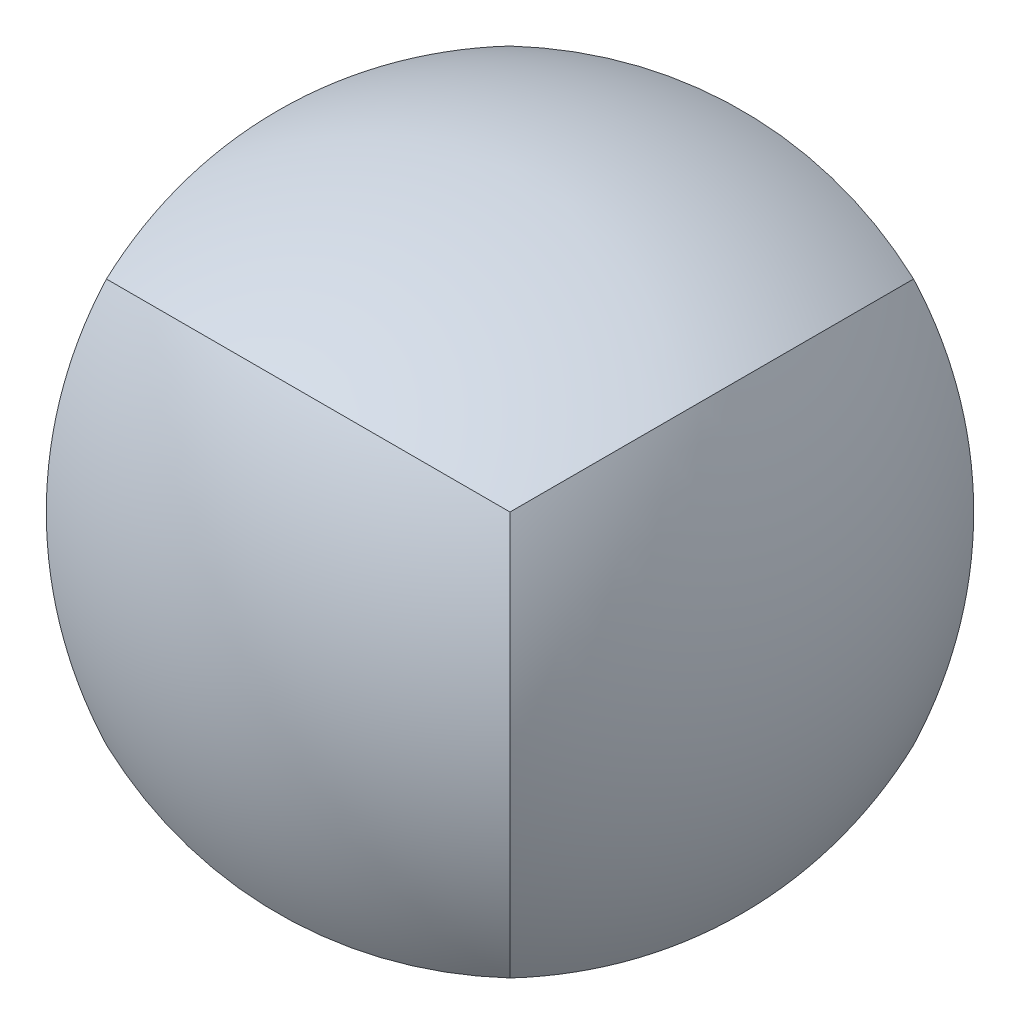
ISO-10303-21;
HEADER;
FILE_DESCRIPTION(('STEP AP214'),'2;1');
FILE_NAME('part.step','',(''),(''),'','','');
FILE_SCHEMA(('AUTOMOTIVE_DESIGN { 1 0 10303 214 1 1 1 1 }'));
ENDSEC;
DATA;
#1=APPLICATION_CONTEXT('core data for automotive mechanical design processes');
#2=APPLICATION_PROTOCOL_DEFINITION('international standard','automotive_design',2000,#1);
#3=PRODUCT_CONTEXT('',#1,'mechanical');
#4=PRODUCT('Part','Part','',(#3));
#5=PRODUCT_RELATED_PRODUCT_CATEGORY('part','',(#4));
#6=PRODUCT_DEFINITION_FORMATION('','',#4);
#7=PRODUCT_DEFINITION_CONTEXT('part definition',#1,'design');
#8=PRODUCT_DEFINITION('design','',#6,#7);
#9=PRODUCT_DEFINITION_SHAPE('','',#8);
#10=(LENGTH_UNIT() NAMED_UNIT(*) SI_UNIT(.MILLI.,.METRE.));
#11=(NAMED_UNIT(*) PLANE_ANGLE_UNIT() SI_UNIT($,.RADIAN.));
#12=(NAMED_UNIT(*) SI_UNIT($,.STERADIAN.) SOLID_ANGLE_UNIT());
#13=UNCERTAINTY_MEASURE_WITH_UNIT(LENGTH_MEASURE(1.E-05),#10,'distance_accuracy_value','');
#14=(GEOMETRIC_REPRESENTATION_CONTEXT(3) GLOBAL_UNCERTAINTY_ASSIGNED_CONTEXT((#13)) GLOBAL_UNIT_ASSIGNED_CONTEXT((#10,
#11,#12)) REPRESENTATION_CONTEXT('',''));
#15=CARTESIAN_POINT('',(0.,0.,0.));
#16=DIRECTION('',(0.,0.,1.));
#17=DIRECTION('',(1.,0.,0.));
#18=AXIS2_PLACEMENT_3D('',#15,#16,#17);
#19=CARTESIAN_POINT('',(15.3302752875271,1.06603470118587E-13,0.));
#20=DIRECTION('',(0.,1.,0.));
#21=DIRECTION('',(-0.707106781186546,0.,-0.707106781186549));
#22=AXIS2_PLACEMENT_3D('',#19,#20,#21);
#23=SPHERICAL_SURFACE('',#22,33.2907874995271);
#24=CARTESIAN_POINT('',(7.66513764376355,-7.66513764376347,0.));
#25=DIRECTION('',(0.707106781186544,0.707106781186551,0.));
#26=DIRECTION('',(-0.707106781186551,0.707106781186544,0.));
#27=AXIS2_PLACEMENT_3D('',#24,#25,#26);
#28=CIRCLE('',#27,31.4764652104232);
#29=CARTESIAN_POINT('',(-12.7000018682677,12.7000018682675,-12.7000018682677));
#30=VERTEX_POINT('',#29);
#31=CARTESIAN_POINT('',(-12.7000018682677,12.7000018682676,12.7000018682676));
#32=VERTEX_POINT('',#31);
#33=EDGE_CURVE('E37',#30,#32,#28,.T.);
#34=ORIENTED_EDGE('',*,*,#33,.F.);
#35=CARTESIAN_POINT('',(7.66513764376345,0.,7.66513764376353));
#36=DIRECTION('',(0.707106781186551,0.,-0.707106781186544));
#37=DIRECTION('',(-0.707106781186544,0.,-0.707106781186551));
#38=AXIS2_PLACEMENT_3D('',#35,#36,#37);
#39=CIRCLE('',#38,31.4764652104232);
#40=CARTESIAN_POINT('',(-12.7000018682675,-12.7000018682677,-12.7000018682677));
#41=VERTEX_POINT('',#40);
#42=EDGE_CURVE('E76',#41,#30,#39,.T.);
#43=ORIENTED_EDGE('',*,*,#42,.F.);
#44=CARTESIAN_POINT('',(7.66513764376345,7.66513764376358,0.));
#45=DIRECTION('',(0.707106781186554,-0.707106781186541,0.));
#46=DIRECTION('',(0.707106781186541,0.707106781186554,0.));
#47=AXIS2_PLACEMENT_3D('',#44,#45,#46);
#48=CIRCLE('',#47,31.4764652104232);
#49=CARTESIAN_POINT('',(-12.7000018682675,-12.7000018682678,12.7000018682675));
#50=VERTEX_POINT('',#49);
#51=EDGE_CURVE('E70',#50,#41,#48,.T.);
#52=ORIENTED_EDGE('',*,*,#51,.F.);
#53=CARTESIAN_POINT('',(7.66513764376355,0.,-7.66513764376352));
#54=DIRECTION('',(0.707106781186546,0.,0.707106781186549));
#55=DIRECTION('',(0.707106781186549,0.,-0.707106781186546));
#56=AXIS2_PLACEMENT_3D('',#53,#54,#55);
#57=CIRCLE('',#56,31.4764652104233);
#58=EDGE_CURVE('E86',#32,#50,#57,.T.);
#59=ORIENTED_EDGE('',*,*,#58,.F.);
#60=EDGE_LOOP('',(#34,#43,#52,#59));
#61=FACE_BOUND('',#60,.T.);
#62=ADVANCED_FACE('F34',(#61),#23,.T.);
#63=CARTESIAN_POINT('',(0.,-15.3302752875271,0.));
#64=DIRECTION('',(1.,0.,0.));
#65=DIRECTION('',(0.,0.707106781186546,-0.707106781186549));
#66=AXIS2_PLACEMENT_3D('',#63,#64,#65);
#67=SPHERICAL_SURFACE('',#66,33.2907874995271);
#68=ORIENTED_EDGE('',*,*,#33,.T.);
#69=CARTESIAN_POINT('',(0.,-7.6651376437635,-7.66513764376352));
#70=DIRECTION('',(0.,-0.707106781186549,0.707106781186546));
#71=DIRECTION('',(0.,-0.707106781186546,-0.707106781186549));
#72=AXIS2_PLACEMENT_3D('',#69,#70,#71);
#73=CIRCLE('',#72,31.4764652104232);
#74=CARTESIAN_POINT('',(12.7000018682676,12.7000018682676,12.7000018682677));
#75=VERTEX_POINT('',#74);
#76=EDGE_CURVE('E95',#75,#32,#73,.T.);
#77=ORIENTED_EDGE('',*,*,#76,.F.);
#78=CARTESIAN_POINT('',(-7.6651376437635,-7.66513764376353,0.));
#79=DIRECTION('',(0.707106781186549,-0.707106781186546,0.));
#80=DIRECTION('',(0.707106781186546,0.707106781186549,0.));
#81=AXIS2_PLACEMENT_3D('',#78,#79,#80);
#82=CIRCLE('',#81,31.4764652104232);
#83=CARTESIAN_POINT('',(12.7000018682677,12.7000018682677,-12.7000018682675));
#84=VERTEX_POINT('',#83);
#85=EDGE_CURVE('E51',#84,#75,#82,.T.);
#86=ORIENTED_EDGE('',*,*,#85,.F.);
#87=CARTESIAN_POINT('',(0.,-7.66513764376355,7.66513764376353));
#88=DIRECTION('',(0.,-0.707106781186546,-0.707106781186549));
#89=DIRECTION('',(0.,0.707106781186549,-0.707106781186546));
#90=AXIS2_PLACEMENT_3D('',#87,#88,#89);
#91=CIRCLE('',#90,31.4764652104233);
#92=EDGE_CURVE('E81',#30,#84,#91,.T.);
#93=ORIENTED_EDGE('',*,*,#92,.F.);
#94=EDGE_LOOP('',(#68,#77,#86,#93));
#95=FACE_BOUND('',#94,.T.);
#96=ADVANCED_FACE('F89',(#95),#67,.T.);
#97=CARTESIAN_POINT('',(-1.60444863983204E-13,0.,15.3302752875271));
#98=DIRECTION('',(-1.,0.,0.));
#99=DIRECTION('',(0.,0.707106781186551,-0.707106781186544));
#100=AXIS2_PLACEMENT_3D('',#97,#98,#99);
#101=SPHERICAL_SURFACE('',#100,33.2907874995271);
#102=ORIENTED_EDGE('',*,*,#42,.T.);
#103=ORIENTED_EDGE('',*,*,#92,.T.);
#104=CARTESIAN_POINT('',(-7.66513764376361,0.,7.66513764376352));
#105=DIRECTION('',(0.707106781186544,0.,0.707106781186551));
#106=DIRECTION('',(0.707106781186551,0.,-0.707106781186544));
#107=AXIS2_PLACEMENT_3D('',#104,#105,#106);
#108=CIRCLE('',#107,31.4764652104233);
#109=CARTESIAN_POINT('',(12.7000018682677,-12.7000018682675,-12.7000018682676));
#110=VERTEX_POINT('',#109);
#111=EDGE_CURVE('E100',#110,#84,#108,.T.);
#112=ORIENTED_EDGE('',*,*,#111,.F.);
#113=CARTESIAN_POINT('',(-1.60444863983204E-13,7.6651376437635,7.66513764376353));
#114=DIRECTION('',(0.,-0.707106781186549,0.707106781186546));
#115=DIRECTION('',(0.,-0.707106781186546,-0.707106781186549));
#116=AXIS2_PLACEMENT_3D('',#113,#114,#115);
#117=CIRCLE('',#116,31.4764652104232);
#118=EDGE_CURVE('E82',#41,#110,#117,.T.);
#119=ORIENTED_EDGE('',*,*,#118,.F.);
#120=EDGE_LOOP('',(#102,#103,#112,#119));
#121=FACE_BOUND('',#120,.T.);
#122=ADVANCED_FACE('F78',(#121),#101,.T.);
#123=CARTESIAN_POINT('',(-1.60444863983204E-13,15.3302752875271,0.));
#124=DIRECTION('',(-1.,0.,0.));
#125=DIRECTION('',(0.,-0.707106781186546,-0.707106781186549));
#126=AXIS2_PLACEMENT_3D('',#123,#124,#125);
#127=SPHERICAL_SURFACE('',#126,33.2907874995271);
#128=ORIENTED_EDGE('',*,*,#51,.T.);
#129=ORIENTED_EDGE('',*,*,#118,.T.);
#130=CARTESIAN_POINT('',(-7.66513764376361,7.66513764376352,0.));
#131=DIRECTION('',(0.707106781186544,0.707106781186551,0.));
#132=DIRECTION('',(-0.707106781186551,0.707106781186544,0.));
#133=AXIS2_PLACEMENT_3D('',#130,#131,#132);
#134=CIRCLE('',#133,31.4764652104233);
#135=CARTESIAN_POINT('',(12.7000018682677,-12.7000018682675,12.7000018682677));
#136=VERTEX_POINT('',#135);
#137=EDGE_CURVE('E43',#136,#110,#134,.T.);
#138=ORIENTED_EDGE('',*,*,#137,.F.);
#139=CARTESIAN_POINT('',(0.,7.66513764376355,-7.66513764376352));
#140=DIRECTION('',(0.,0.707106781186546,0.707106781186549));
#141=DIRECTION('',(0.,-0.707106781186549,0.707106781186546));
#142=AXIS2_PLACEMENT_3D('',#139,#140,#141);
#143=CIRCLE('',#142,31.4764652104233);
#144=EDGE_CURVE('E93',#50,#136,#143,.T.);
#145=ORIENTED_EDGE('',*,*,#144,.F.);
#146=EDGE_LOOP('',(#128,#129,#138,#145));
#147=FACE_BOUND('',#146,.T.);
#148=ADVANCED_FACE('F105',(#147),#127,.T.);
#149=CARTESIAN_POINT('',(0.,0.,-15.3302752875271));
#150=DIRECTION('',(1.,0.,0.));
#151=DIRECTION('',(0.,0.707106781186546,0.707106781186549));
#152=AXIS2_PLACEMENT_3D('',#149,#150,#151);
#153=SPHERICAL_SURFACE('',#152,33.2907874995271);
#154=ORIENTED_EDGE('',*,*,#58,.T.);
#155=ORIENTED_EDGE('',*,*,#144,.T.);
#156=CARTESIAN_POINT('',(-7.6651376437635,0.,-7.66513764376353));
#157=DIRECTION('',(0.707106781186549,0.,-0.707106781186546));
#158=DIRECTION('',(-0.707106781186546,0.,-0.707106781186549));
#159=AXIS2_PLACEMENT_3D('',#156,#157,#158);
#160=CIRCLE('',#159,31.4764652104232);
#161=EDGE_CURVE('E11',#75,#136,#160,.T.);
#162=ORIENTED_EDGE('',*,*,#161,.F.);
#163=ORIENTED_EDGE('',*,*,#76,.T.);
#164=EDGE_LOOP('',(#154,#155,#162,#163));
#165=FACE_BOUND('',#164,.T.);
#166=ADVANCED_FACE('F108',(#165),#153,.T.);
#167=CARTESIAN_POINT('',(-15.3302752875271,0.,0.));
#168=DIRECTION('',(0.,-1.,0.));
#169=DIRECTION('',(0.707106781186546,0.,-0.707106781186549));
#170=AXIS2_PLACEMENT_3D('',#167,#168,#169);
#171=SPHERICAL_SURFACE('',#170,33.2907874995271);
#172=ORIENTED_EDGE('',*,*,#85,.T.);
#173=ORIENTED_EDGE('',*,*,#161,.T.);
#174=ORIENTED_EDGE('',*,*,#137,.T.);
#175=ORIENTED_EDGE('',*,*,#111,.T.);
#176=EDGE_LOOP('',(#172,#173,#174,#175));
#177=FACE_BOUND('',#176,.T.);
#178=ADVANCED_FACE('F102',(#177),#171,.T.);
#179=CLOSED_SHELL('',(#62,#96,#122,#148,#166,#178));
#180=MANIFOLD_SOLID_BREP('B2',#179);
#181=ADVANCED_BREP_SHAPE_REPRESENTATION('',(#18,#180),#14);
#182=SHAPE_DEFINITION_REPRESENTATION(#9,#181);
ENDSEC;
END-ISO-10303-21;
